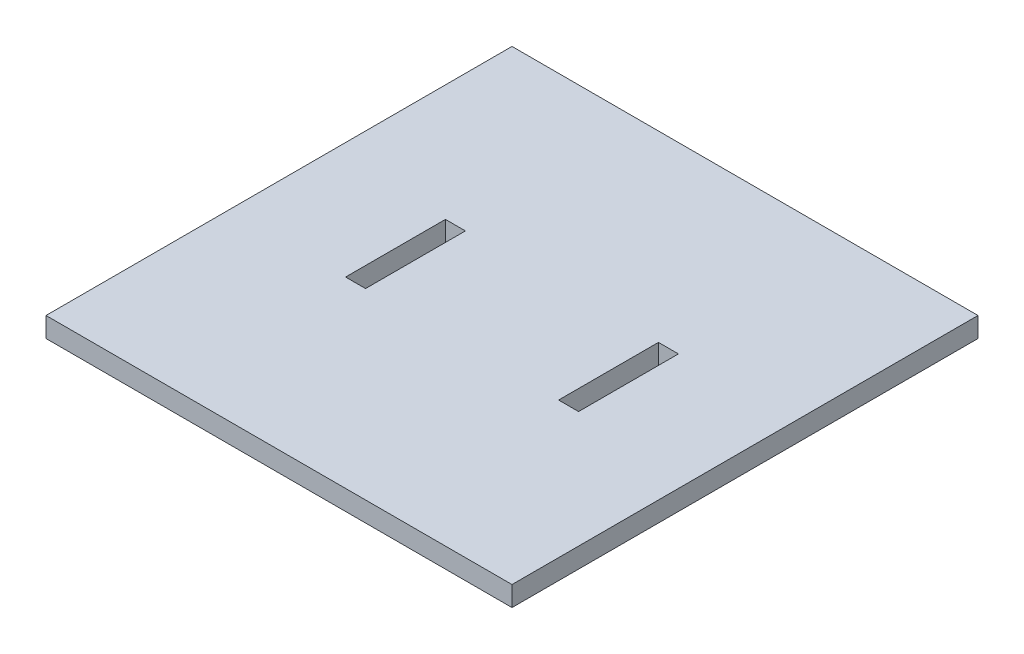
ISO-10303-21;
HEADER;
FILE_DESCRIPTION(('STEP AP214'),'2;1');
FILE_NAME('part.step','',(''),(''),'','','');
FILE_SCHEMA(('AUTOMOTIVE_DESIGN { 1 0 10303 214 1 1 1 1 }'));
ENDSEC;
DATA;
#1=APPLICATION_CONTEXT('core data for automotive mechanical design processes');
#2=APPLICATION_PROTOCOL_DEFINITION('international standard','automotive_design',2000,#1);
#3=PRODUCT_CONTEXT('',#1,'mechanical');
#4=PRODUCT('Part','Part','',(#3));
#5=PRODUCT_RELATED_PRODUCT_CATEGORY('part','',(#4));
#6=PRODUCT_DEFINITION_FORMATION('','',#4);
#7=PRODUCT_DEFINITION_CONTEXT('part definition',#1,'design');
#8=PRODUCT_DEFINITION('design','',#6,#7);
#9=PRODUCT_DEFINITION_SHAPE('','',#8);
#10=(LENGTH_UNIT() NAMED_UNIT(*) SI_UNIT(.MILLI.,.METRE.));
#11=(NAMED_UNIT(*) PLANE_ANGLE_UNIT() SI_UNIT($,.RADIAN.));
#12=(NAMED_UNIT(*) SI_UNIT($,.STERADIAN.) SOLID_ANGLE_UNIT());
#13=UNCERTAINTY_MEASURE_WITH_UNIT(LENGTH_MEASURE(1.E-05),#10,'distance_accuracy_value','');
#14=(GEOMETRIC_REPRESENTATION_CONTEXT(3) GLOBAL_UNCERTAINTY_ASSIGNED_CONTEXT((#13)) GLOBAL_UNIT_ASSIGNED_CONTEXT((#10,
#11,#12)) REPRESENTATION_CONTEXT('',''));
#15=CARTESIAN_POINT('',(0.,0.,0.));
#16=DIRECTION('',(0.,0.,1.));
#17=DIRECTION('',(1.,0.,0.));
#18=AXIS2_PLACEMENT_3D('',#15,#16,#17);
#19=CARTESIAN_POINT('',(-14.1494845360825,3.,-27.3582474226804));
#20=DIRECTION('',(1.,0.,0.));
#21=DIRECTION('',(0.,0.,-1.));
#22=AXIS2_PLACEMENT_3D('',#19,#20,#21);
#23=PLANE('',#22);
#24=DIRECTION('',(0.,0.,1.));
#25=VECTOR('',#24,1.);
#26=CARTESIAN_POINT('',(-14.1494845360825,0.,-27.3582474226804));
#27=LINE('',#26,#25);
#28=CARTESIAN_POINT('',(-14.1494845360825,0.,-27.3582474226804));
#29=VERTEX_POINT('',#28);
#30=CARTESIAN_POINT('',(-14.1494845360825,0.,42.6417525773196));
#31=VERTEX_POINT('',#30);
#32=EDGE_CURVE('E156',#29,#31,#27,.T.);
#33=ORIENTED_EDGE('',*,*,#32,.T.);
#34=DIRECTION('',(0.,-1.,0.));
#35=VECTOR('',#34,1.);
#36=CARTESIAN_POINT('',(-14.1494845360825,3.,42.6417525773196));
#37=LINE('',#36,#35);
#38=CARTESIAN_POINT('',(-14.1494845360825,3.,42.6417525773196));
#39=VERTEX_POINT('',#38);
#40=EDGE_CURVE('E11',#39,#31,#37,.T.);
#41=ORIENTED_EDGE('',*,*,#40,.F.);
#42=DIRECTION('',(0.,0.,1.));
#43=VECTOR('',#42,1.);
#44=CARTESIAN_POINT('',(-14.1494845360825,3.,-27.3582474226804));
#45=LINE('',#44,#43);
#46=CARTESIAN_POINT('',(-14.1494845360825,3.,-27.3582474226804));
#47=VERTEX_POINT('',#46);
#48=EDGE_CURVE('E185',#47,#39,#45,.T.);
#49=ORIENTED_EDGE('',*,*,#48,.F.);
#50=DIRECTION('',(0.,-1.,0.));
#51=VECTOR('',#50,1.);
#52=CARTESIAN_POINT('',(-14.1494845360825,3.,-27.3582474226804));
#53=LINE('',#52,#51);
#54=EDGE_CURVE('E195',#47,#29,#53,.T.);
#55=ORIENTED_EDGE('',*,*,#54,.T.);
#56=EDGE_LOOP('',(#33,#41,#49,#55));
#57=FACE_BOUND('',#56,.T.);
#58=ADVANCED_FACE('F33',(#57),#23,.F.);
#59=CARTESIAN_POINT('',(-14.1494845360825,3.,42.6417525773196));
#60=DIRECTION('',(0.,0.,-1.));
#61=DIRECTION('',(-1.,0.,0.));
#62=AXIS2_PLACEMENT_3D('',#59,#60,#61);
#63=PLANE('',#62);
#64=DIRECTION('',(1.,0.,0.));
#65=VECTOR('',#64,1.);
#66=CARTESIAN_POINT('',(-14.1494845360825,0.,42.6417525773196));
#67=LINE('',#66,#65);
#68=CARTESIAN_POINT('',(55.8505154639175,0.,42.6417525773196));
#69=VERTEX_POINT('',#68);
#70=EDGE_CURVE('E198',#31,#69,#67,.T.);
#71=ORIENTED_EDGE('',*,*,#70,.T.);
#72=DIRECTION('',(0.,-1.,0.));
#73=VECTOR('',#72,1.);
#74=CARTESIAN_POINT('',(55.8505154639175,3.,42.6417525773196));
#75=LINE('',#74,#73);
#76=CARTESIAN_POINT('',(55.8505154639175,3.,42.6417525773196));
#77=VERTEX_POINT('',#76);
#78=EDGE_CURVE('E40',#77,#69,#75,.T.);
#79=ORIENTED_EDGE('',*,*,#78,.F.);
#80=DIRECTION('',(1.,0.,0.));
#81=VECTOR('',#80,1.);
#82=CARTESIAN_POINT('',(-14.1494845360825,3.,42.6417525773196));
#83=LINE('',#82,#81);
#84=EDGE_CURVE('E188',#39,#77,#83,.T.);
#85=ORIENTED_EDGE('',*,*,#84,.F.);
#86=ORIENTED_EDGE('',*,*,#40,.T.);
#87=EDGE_LOOP('',(#71,#79,#85,#86));
#88=FACE_BOUND('',#87,.T.);
#89=ADVANCED_FACE('F227',(#88),#63,.F.);
#90=CARTESIAN_POINT('',(55.8505154639175,3.,-27.3582474226804));
#91=DIRECTION('',(-1.,0.,0.));
#92=DIRECTION('',(0.,0.,1.));
#93=AXIS2_PLACEMENT_3D('',#90,#91,#92);
#94=PLANE('',#93);
#95=DIRECTION('',(0.,0.,-1.));
#96=VECTOR('',#95,1.);
#97=CARTESIAN_POINT('',(55.8505154639175,0.,-27.3582474226804));
#98=LINE('',#97,#96);
#99=CARTESIAN_POINT('',(55.8505154639175,0.,-27.3582474226804));
#100=VERTEX_POINT('',#99);
#101=EDGE_CURVE('E200',#69,#100,#98,.T.);
#102=ORIENTED_EDGE('',*,*,#101,.T.);
#103=DIRECTION('',(0.,-1.,0.));
#104=VECTOR('',#103,1.);
#105=CARTESIAN_POINT('',(55.8505154639175,3.,-27.3582474226804));
#106=LINE('',#105,#104);
#107=CARTESIAN_POINT('',(55.8505154639175,3.,-27.3582474226804));
#108=VERTEX_POINT('',#107);
#109=EDGE_CURVE('E205',#108,#100,#106,.T.);
#110=ORIENTED_EDGE('',*,*,#109,.F.);
#111=DIRECTION('',(0.,0.,-1.));
#112=VECTOR('',#111,1.);
#113=CARTESIAN_POINT('',(55.8505154639175,3.,-27.3582474226804));
#114=LINE('',#113,#112);
#115=EDGE_CURVE('E191',#77,#108,#114,.T.);
#116=ORIENTED_EDGE('',*,*,#115,.F.);
#117=ORIENTED_EDGE('',*,*,#78,.T.);
#118=EDGE_LOOP('',(#102,#110,#116,#117));
#119=FACE_BOUND('',#118,.T.);
#120=ADVANCED_FACE('F212',(#119),#94,.F.);
#121=CARTESIAN_POINT('',(-14.1494845360825,3.,-27.3582474226804));
#122=DIRECTION('',(0.,0.,1.));
#123=DIRECTION('',(1.,0.,0.));
#124=AXIS2_PLACEMENT_3D('',#121,#122,#123);
#125=PLANE('',#124);
#126=DIRECTION('',(-1.,0.,0.));
#127=VECTOR('',#126,1.);
#128=CARTESIAN_POINT('',(-14.1494845360825,0.,-27.3582474226804));
#129=LINE('',#128,#127);
#130=EDGE_CURVE('E189',#100,#29,#129,.T.);
#131=ORIENTED_EDGE('',*,*,#130,.T.);
#132=ORIENTED_EDGE('',*,*,#54,.F.);
#133=DIRECTION('',(-1.,0.,0.));
#134=VECTOR('',#133,1.);
#135=CARTESIAN_POINT('',(-14.1494845360825,3.,-27.3582474226804));
#136=LINE('',#135,#134);
#137=EDGE_CURVE('E193',#108,#47,#136,.T.);
#138=ORIENTED_EDGE('',*,*,#137,.F.);
#139=ORIENTED_EDGE('',*,*,#109,.T.);
#140=EDGE_LOOP('',(#131,#132,#138,#139));
#141=FACE_BOUND('',#140,.T.);
#142=ADVANCED_FACE('F221',(#141),#125,.F.);
#143=CARTESIAN_POINT('',(0.,3.,0.));
#144=DIRECTION('',(0.,1.,0.));
#145=DIRECTION('',(0.,0.,1.));
#146=AXIS2_PLACEMENT_3D('',#143,#144,#145);
#147=PLANE('',#146);
#148=DIRECTION('',(-1.,0.,0.));
#149=VECTOR('',#148,1.);
#150=CARTESIAN_POINT('',(6.35051546391753,3.,0.141752577319578));
#151=LINE('',#150,#149);
#152=CARTESIAN_POINT('',(6.35051546391753,3.,0.141752577319578));
#153=VERTEX_POINT('',#152);
#154=CARTESIAN_POINT('',(3.35051546391753,3.,0.141752577319579));
#155=VERTEX_POINT('',#154);
#156=EDGE_CURVE('E47',#153,#155,#151,.T.);
#157=ORIENTED_EDGE('',*,*,#156,.F.);
#158=DIRECTION('',(0.,0.,-1.));
#159=VECTOR('',#158,1.);
#160=CARTESIAN_POINT('',(6.35051546391753,3.,15.1417525773196));
#161=LINE('',#160,#159);
#162=CARTESIAN_POINT('',(6.35051546391753,3.,15.1417525773196));
#163=VERTEX_POINT('',#162);
#164=EDGE_CURVE('E145',#163,#153,#161,.T.);
#165=ORIENTED_EDGE('',*,*,#164,.F.);
#166=DIRECTION('',(1.,0.,0.));
#167=VECTOR('',#166,1.);
#168=CARTESIAN_POINT('',(3.35051546391753,3.,15.1417525773196));
#169=LINE('',#168,#167);
#170=CARTESIAN_POINT('',(3.35051546391753,3.,15.1417525773196));
#171=VERTEX_POINT('',#170);
#172=EDGE_CURVE('E128',#171,#163,#169,.T.);
#173=ORIENTED_EDGE('',*,*,#172,.F.);
#174=DIRECTION('',(0.,0.,1.));
#175=VECTOR('',#174,1.);
#176=CARTESIAN_POINT('',(3.35051546391753,3.,0.141752577319579));
#177=LINE('',#176,#175);
#178=EDGE_CURVE('E138',#155,#171,#177,.T.);
#179=ORIENTED_EDGE('',*,*,#178,.F.);
#180=EDGE_LOOP('',(#157,#165,#173,#179));
#181=FACE_BOUND('',#180,.T.);
#182=DIRECTION('',(1.,0.,0.));
#183=VECTOR('',#182,1.);
#184=CARTESIAN_POINT('',(38.3505154639175,3.,15.1417525773196));
#185=LINE('',#184,#183);
#186=CARTESIAN_POINT('',(35.3505154639175,3.,15.1417525773196));
#187=VERTEX_POINT('',#186);
#188=CARTESIAN_POINT('',(38.3505154639175,3.,15.1417525773196));
#189=VERTEX_POINT('',#188);
#190=EDGE_CURVE('E55',#187,#189,#185,.T.);
#191=ORIENTED_EDGE('',*,*,#190,.F.);
#192=DIRECTION('',(0.,0.,1.));
#193=VECTOR('',#192,1.);
#194=CARTESIAN_POINT('',(35.3505154639175,3.,15.1417525773196));
#195=LINE('',#194,#193);
#196=CARTESIAN_POINT('',(35.3505154639175,3.,0.141752577319578));
#197=VERTEX_POINT('',#196);
#198=EDGE_CURVE('E174',#197,#187,#195,.T.);
#199=ORIENTED_EDGE('',*,*,#198,.F.);
#200=DIRECTION('',(-1.,0.,0.));
#201=VECTOR('',#200,1.);
#202=CARTESIAN_POINT('',(35.3505154639175,3.,0.141752577319578));
#203=LINE('',#202,#201);
#204=CARTESIAN_POINT('',(38.3505154639175,3.,0.141752577319579));
#205=VERTEX_POINT('',#204);
#206=EDGE_CURVE('E171',#205,#197,#203,.T.);
#207=ORIENTED_EDGE('',*,*,#206,.F.);
#208=DIRECTION('',(0.,0.,-1.));
#209=VECTOR('',#208,1.);
#210=CARTESIAN_POINT('',(38.3505154639175,3.,0.141752577319579));
#211=LINE('',#210,#209);
#212=EDGE_CURVE('E168',#189,#205,#211,.T.);
#213=ORIENTED_EDGE('',*,*,#212,.F.);
#214=EDGE_LOOP('',(#191,#199,#207,#213));
#215=FACE_BOUND('',#214,.T.);
#216=ORIENTED_EDGE('',*,*,#48,.T.);
#217=ORIENTED_EDGE('',*,*,#84,.T.);
#218=ORIENTED_EDGE('',*,*,#115,.T.);
#219=ORIENTED_EDGE('',*,*,#137,.T.);
#220=EDGE_LOOP('',(#216,#217,#218,#219));
#221=FACE_BOUND('',#220,.T.);
#222=ADVANCED_FACE('F142',(#181,#215,#221),#147,.T.);
#223=CARTESIAN_POINT('',(0.,0.,0.));
#224=DIRECTION('',(0.,1.,0.));
#225=DIRECTION('',(0.,0.,1.));
#226=AXIS2_PLACEMENT_3D('',#223,#224,#225);
#227=PLANE('',#226);
#228=DIRECTION('',(0.,0.,1.));
#229=VECTOR('',#228,1.);
#230=CARTESIAN_POINT('',(6.35051546391753,0.,15.1417525773196));
#231=LINE('',#230,#229);
#232=CARTESIAN_POINT('',(6.35051546391753,0.,0.141752577319578));
#233=VERTEX_POINT('',#232);
#234=CARTESIAN_POINT('',(6.35051546391753,0.,15.1417525773196));
#235=VERTEX_POINT('',#234);
#236=EDGE_CURVE('E271',#233,#235,#231,.T.);
#237=ORIENTED_EDGE('',*,*,#236,.F.);
#238=DIRECTION('',(1.,0.,0.));
#239=VECTOR('',#238,1.);
#240=CARTESIAN_POINT('',(6.35051546391753,0.,0.141752577319578));
#241=LINE('',#240,#239);
#242=CARTESIAN_POINT('',(3.35051546391753,0.,0.141752577319579));
#243=VERTEX_POINT('',#242);
#244=EDGE_CURVE('E157',#243,#233,#241,.T.);
#245=ORIENTED_EDGE('',*,*,#244,.F.);
#246=DIRECTION('',(0.,0.,-1.));
#247=VECTOR('',#246,1.);
#248=CARTESIAN_POINT('',(3.35051546391753,0.,0.141752577319579));
#249=LINE('',#248,#247);
#250=CARTESIAN_POINT('',(3.35051546391753,0.,15.1417525773196));
#251=VERTEX_POINT('',#250);
#252=EDGE_CURVE('E154',#251,#243,#249,.T.);
#253=ORIENTED_EDGE('',*,*,#252,.F.);
#254=DIRECTION('',(-1.,0.,0.));
#255=VECTOR('',#254,1.);
#256=CARTESIAN_POINT('',(3.35051546391753,0.,15.1417525773196));
#257=LINE('',#256,#255);
#258=EDGE_CURVE('E131',#235,#251,#257,.T.);
#259=ORIENTED_EDGE('',*,*,#258,.F.);
#260=EDGE_LOOP('',(#237,#245,#253,#259));
#261=FACE_BOUND('',#260,.T.);
#262=DIRECTION('',(0.,0.,-1.));
#263=VECTOR('',#262,1.);
#264=CARTESIAN_POINT('',(35.3505154639175,0.,15.1417525773196));
#265=LINE('',#264,#263);
#266=CARTESIAN_POINT('',(35.3505154639175,0.,15.1417525773196));
#267=VERTEX_POINT('',#266);
#268=CARTESIAN_POINT('',(35.3505154639175,0.,0.141752577319578));
#269=VERTEX_POINT('',#268);
#270=EDGE_CURVE('E161',#267,#269,#265,.T.);
#271=ORIENTED_EDGE('',*,*,#270,.F.);
#272=DIRECTION('',(-1.,0.,0.));
#273=VECTOR('',#272,1.);
#274=CARTESIAN_POINT('',(38.3505154639175,0.,15.1417525773196));
#275=LINE('',#274,#273);
#276=CARTESIAN_POINT('',(38.3505154639175,0.,15.1417525773196));
#277=VERTEX_POINT('',#276);
#278=EDGE_CURVE('E164',#277,#267,#275,.T.);
#279=ORIENTED_EDGE('',*,*,#278,.F.);
#280=DIRECTION('',(0.,0.,1.));
#281=VECTOR('',#280,1.);
#282=CARTESIAN_POINT('',(38.3505154639175,0.,0.141752577319579));
#283=LINE('',#282,#281);
#284=CARTESIAN_POINT('',(38.3505154639175,0.,0.141752577319579));
#285=VERTEX_POINT('',#284);
#286=EDGE_CURVE('E166',#285,#277,#283,.T.);
#287=ORIENTED_EDGE('',*,*,#286,.F.);
#288=DIRECTION('',(1.,0.,0.));
#289=VECTOR('',#288,1.);
#290=CARTESIAN_POINT('',(35.3505154639175,0.,0.141752577319578));
#291=LINE('',#290,#289);
#292=EDGE_CURVE('E158',#269,#285,#291,.T.);
#293=ORIENTED_EDGE('',*,*,#292,.F.);
#294=EDGE_LOOP('',(#271,#279,#287,#293));
#295=FACE_BOUND('',#294,.T.);
#296=ORIENTED_EDGE('',*,*,#32,.F.);
#297=ORIENTED_EDGE('',*,*,#130,.F.);
#298=ORIENTED_EDGE('',*,*,#101,.F.);
#299=ORIENTED_EDGE('',*,*,#70,.F.);
#300=EDGE_LOOP('',(#296,#297,#298,#299));
#301=FACE_BOUND('',#300,.T.);
#302=ADVANCED_FACE('F218',(#261,#295,#301),#227,.F.);
#303=CARTESIAN_POINT('',(38.3505154639175,-15.2970585407784,15.1417525773196));
#304=DIRECTION('',(0.,0.,1.));
#305=DIRECTION('',(1.,0.,0.));
#306=AXIS2_PLACEMENT_3D('',#303,#304,#305);
#307=PLANE('',#306);
#308=ORIENTED_EDGE('',*,*,#278,.T.);
#309=DIRECTION('',(0.,1.,0.));
#310=VECTOR('',#309,1.);
#311=CARTESIAN_POINT('',(35.3505154639175,-15.2970585407784,15.1417525773196));
#312=LINE('',#311,#310);
#313=EDGE_CURVE('E162',#267,#187,#312,.T.);
#314=ORIENTED_EDGE('',*,*,#313,.T.);
#315=ORIENTED_EDGE('',*,*,#190,.T.);
#316=DIRECTION('',(0.,1.,0.));
#317=VECTOR('',#316,1.);
#318=CARTESIAN_POINT('',(38.3505154639175,-15.2970585407784,15.1417525773196));
#319=LINE('',#318,#317);
#320=EDGE_CURVE('E177',#277,#189,#319,.T.);
#321=ORIENTED_EDGE('',*,*,#320,.F.);
#322=EDGE_LOOP('',(#308,#314,#315,#321));
#323=FACE_BOUND('',#322,.T.);
#324=ADVANCED_FACE('F239',(#323),#307,.F.);
#325=CARTESIAN_POINT('',(35.3505154639175,-15.2970585407784,15.1417525773196));
#326=DIRECTION('',(-1.,0.,0.));
#327=DIRECTION('',(0.,0.,1.));
#328=AXIS2_PLACEMENT_3D('',#325,#326,#327);
#329=PLANE('',#328);
#330=ORIENTED_EDGE('',*,*,#270,.T.);
#331=DIRECTION('',(0.,1.,0.));
#332=VECTOR('',#331,1.);
#333=CARTESIAN_POINT('',(35.3505154639175,-15.2970585407784,0.141752577319578));
#334=LINE('',#333,#332);
#335=EDGE_CURVE('E179',#269,#197,#334,.T.);
#336=ORIENTED_EDGE('',*,*,#335,.T.);
#337=ORIENTED_EDGE('',*,*,#198,.T.);
#338=ORIENTED_EDGE('',*,*,#313,.F.);
#339=EDGE_LOOP('',(#330,#336,#337,#338));
#340=FACE_BOUND('',#339,.T.);
#341=ADVANCED_FACE('F245',(#340),#329,.F.);
#342=CARTESIAN_POINT('',(35.3505154639175,-15.2970585407784,0.141752577319578));
#343=DIRECTION('',(0.,0.,-1.));
#344=DIRECTION('',(-1.,0.,0.));
#345=AXIS2_PLACEMENT_3D('',#342,#343,#344);
#346=PLANE('',#345);
#347=ORIENTED_EDGE('',*,*,#292,.T.);
#348=DIRECTION('',(0.,1.,0.));
#349=VECTOR('',#348,1.);
#350=CARTESIAN_POINT('',(38.3505154639175,-15.2970585407784,0.141752577319579));
#351=LINE('',#350,#349);
#352=EDGE_CURVE('E181',#285,#205,#351,.T.);
#353=ORIENTED_EDGE('',*,*,#352,.T.);
#354=ORIENTED_EDGE('',*,*,#206,.T.);
#355=ORIENTED_EDGE('',*,*,#335,.F.);
#356=EDGE_LOOP('',(#347,#353,#354,#355));
#357=FACE_BOUND('',#356,.T.);
#358=ADVANCED_FACE('F250',(#357),#346,.F.);
#359=CARTESIAN_POINT('',(38.3505154639175,-15.2970585407784,0.141752577319579));
#360=DIRECTION('',(1.,0.,0.));
#361=DIRECTION('',(0.,0.,-1.));
#362=AXIS2_PLACEMENT_3D('',#359,#360,#361);
#363=PLANE('',#362);
#364=ORIENTED_EDGE('',*,*,#286,.T.);
#365=ORIENTED_EDGE('',*,*,#320,.T.);
#366=ORIENTED_EDGE('',*,*,#212,.T.);
#367=ORIENTED_EDGE('',*,*,#352,.F.);
#368=EDGE_LOOP('',(#364,#365,#366,#367));
#369=FACE_BOUND('',#368,.T.);
#370=ADVANCED_FACE('F246',(#369),#363,.F.);
#371=CARTESIAN_POINT('',(6.35051546391753,-15.2970585407784,0.141752577319578));
#372=DIRECTION('',(0.,0.,-1.));
#373=DIRECTION('',(-1.,0.,0.));
#374=AXIS2_PLACEMENT_3D('',#371,#372,#373);
#375=PLANE('',#374);
#376=ORIENTED_EDGE('',*,*,#244,.T.);
#377=DIRECTION('',(0.,1.,0.));
#378=VECTOR('',#377,1.);
#379=CARTESIAN_POINT('',(6.35051546391753,-15.2970585407784,0.141752577319578));
#380=LINE('',#379,#378);
#381=EDGE_CURVE('E150',#233,#153,#380,.T.);
#382=ORIENTED_EDGE('',*,*,#381,.T.);
#383=ORIENTED_EDGE('',*,*,#156,.T.);
#384=DIRECTION('',(0.,1.,0.));
#385=VECTOR('',#384,1.);
#386=CARTESIAN_POINT('',(3.35051546391753,-15.2970585407784,0.141752577319579));
#387=LINE('',#386,#385);
#388=EDGE_CURVE('E135',#243,#155,#387,.T.);
#389=ORIENTED_EDGE('',*,*,#388,.F.);
#390=EDGE_LOOP('',(#376,#382,#383,#389));
#391=FACE_BOUND('',#390,.T.);
#392=ADVANCED_FACE('F249',(#391),#375,.F.);
#393=CARTESIAN_POINT('',(6.35051546391753,-15.2970585407784,15.1417525773196));
#394=DIRECTION('',(1.,0.,0.));
#395=DIRECTION('',(0.,0.,-1.));
#396=AXIS2_PLACEMENT_3D('',#393,#394,#395);
#397=PLANE('',#396);
#398=ORIENTED_EDGE('',*,*,#236,.T.);
#399=DIRECTION('',(0.,1.,0.));
#400=VECTOR('',#399,1.);
#401=CARTESIAN_POINT('',(6.35051546391753,-15.2970585407784,15.1417525773196));
#402=LINE('',#401,#400);
#403=EDGE_CURVE('E134',#235,#163,#402,.T.);
#404=ORIENTED_EDGE('',*,*,#403,.T.);
#405=ORIENTED_EDGE('',*,*,#164,.T.);
#406=ORIENTED_EDGE('',*,*,#381,.F.);
#407=EDGE_LOOP('',(#398,#404,#405,#406));
#408=FACE_BOUND('',#407,.T.);
#409=ADVANCED_FACE('F260',(#408),#397,.F.);
#410=CARTESIAN_POINT('',(3.35051546391753,-15.2970585407784,15.1417525773196));
#411=DIRECTION('',(0.,0.,1.));
#412=DIRECTION('',(1.,0.,0.));
#413=AXIS2_PLACEMENT_3D('',#410,#411,#412);
#414=PLANE('',#413);
#415=ORIENTED_EDGE('',*,*,#258,.T.);
#416=DIRECTION('',(0.,1.,0.));
#417=VECTOR('',#416,1.);
#418=CARTESIAN_POINT('',(3.35051546391753,-15.2970585407784,15.1417525773196));
#419=LINE('',#418,#417);
#420=EDGE_CURVE('E123',#251,#171,#419,.T.);
#421=ORIENTED_EDGE('',*,*,#420,.T.);
#422=ORIENTED_EDGE('',*,*,#172,.T.);
#423=ORIENTED_EDGE('',*,*,#403,.F.);
#424=EDGE_LOOP('',(#415,#421,#422,#423));
#425=FACE_BOUND('',#424,.T.);
#426=ADVANCED_FACE('F125',(#425),#414,.F.);
#427=CARTESIAN_POINT('',(3.35051546391753,-15.2970585407784,0.141752577319579));
#428=DIRECTION('',(-1.,0.,0.));
#429=DIRECTION('',(0.,0.,1.));
#430=AXIS2_PLACEMENT_3D('',#427,#428,#429);
#431=PLANE('',#430);
#432=ORIENTED_EDGE('',*,*,#252,.T.);
#433=ORIENTED_EDGE('',*,*,#388,.T.);
#434=ORIENTED_EDGE('',*,*,#178,.T.);
#435=ORIENTED_EDGE('',*,*,#420,.F.);
#436=EDGE_LOOP('',(#432,#433,#434,#435));
#437=FACE_BOUND('',#436,.T.);
#438=ADVANCED_FACE('F139',(#437),#431,.F.);
#439=CLOSED_SHELL('',(#58,#89,#120,#142,#222,#302,#324,#341,#358,#370,#392,#409,#426,#438));
#440=MANIFOLD_SOLID_BREP('B2',#439);
#441=ADVANCED_BREP_SHAPE_REPRESENTATION('',(#18,#440),#14);
#442=SHAPE_DEFINITION_REPRESENTATION(#9,#441);
ENDSEC;
END-ISO-10303-21;
